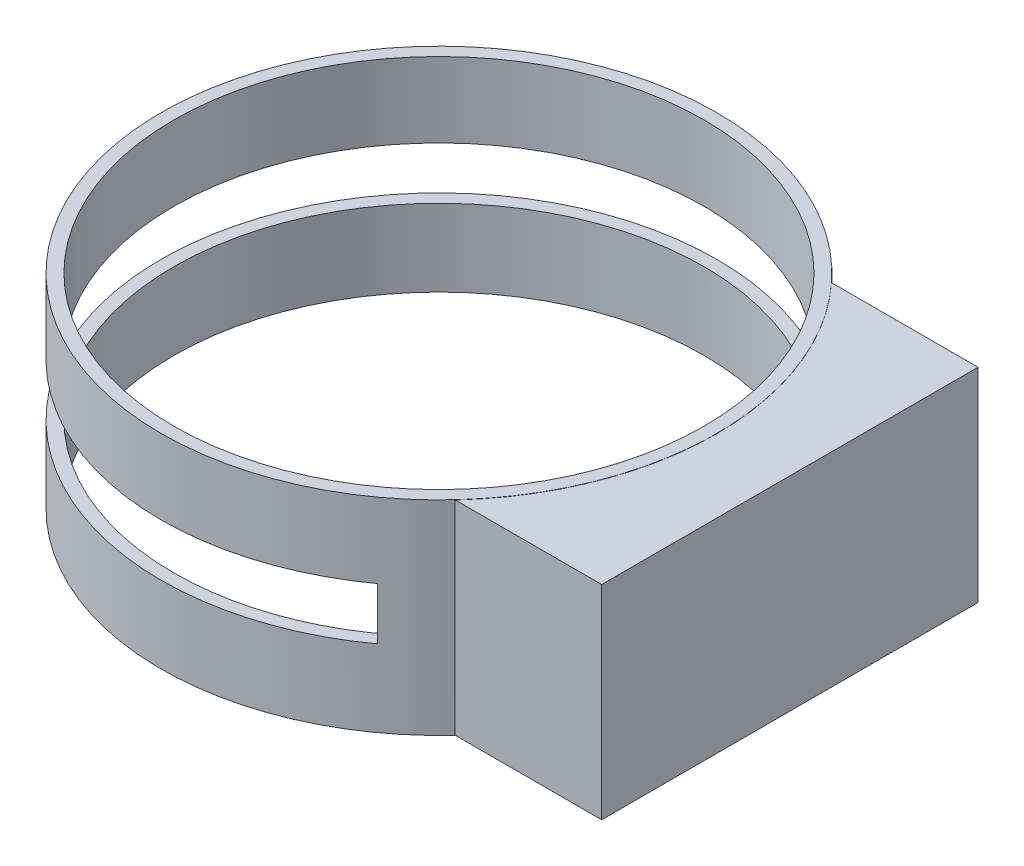
ISO-10303-21;
HEADER;
FILE_DESCRIPTION(('STEP AP214'),'2;1');
FILE_NAME('part.step','',(''),(''),'','','');
FILE_SCHEMA(('AUTOMOTIVE_DESIGN { 1 0 10303 214 1 1 1 1 }'));
ENDSEC;
DATA;
#1=APPLICATION_CONTEXT('core data for automotive mechanical design processes');
#2=APPLICATION_PROTOCOL_DEFINITION('international standard','automotive_design',2000,#1);
#3=PRODUCT_CONTEXT('',#1,'mechanical');
#4=PRODUCT('Part','Part','',(#3));
#5=PRODUCT_RELATED_PRODUCT_CATEGORY('part','',(#4));
#6=PRODUCT_DEFINITION_FORMATION('','',#4);
#7=PRODUCT_DEFINITION_CONTEXT('part definition',#1,'design');
#8=PRODUCT_DEFINITION('design','',#6,#7);
#9=PRODUCT_DEFINITION_SHAPE('','',#8);
#10=(LENGTH_UNIT() NAMED_UNIT(*) SI_UNIT(.MILLI.,.METRE.));
#11=(NAMED_UNIT(*) PLANE_ANGLE_UNIT() SI_UNIT($,.RADIAN.));
#12=(NAMED_UNIT(*) SI_UNIT($,.STERADIAN.) SOLID_ANGLE_UNIT());
#13=UNCERTAINTY_MEASURE_WITH_UNIT(LENGTH_MEASURE(1.E-05),#10,'distance_accuracy_value','');
#14=(GEOMETRIC_REPRESENTATION_CONTEXT(3) GLOBAL_UNCERTAINTY_ASSIGNED_CONTEXT((#13)) GLOBAL_UNIT_ASSIGNED_CONTEXT((#10,
#11,#12)) REPRESENTATION_CONTEXT('',''));
#15=CARTESIAN_POINT('',(0.,0.,0.));
#16=DIRECTION('',(0.,0.,1.));
#17=DIRECTION('',(1.,0.,0.));
#18=AXIS2_PLACEMENT_3D('',#15,#16,#17);
#19=CARTESIAN_POINT('',(0.,50.,0.));
#20=DIRECTION('',(0.,-1.,0.));
#21=DIRECTION('',(0.,0.,-1.));
#22=AXIS2_PLACEMENT_3D('',#19,#20,#21);
#23=CYLINDRICAL_SURFACE('',#22,68.1050389758253);
#24=DIRECTION('',(0.,-1.,0.));
#25=VECTOR('',#24,1.);
#26=CARTESIAN_POINT('',(50.1123956749272,50.,-46.1198886991092));
#27=LINE('',#26,#25);
#28=CARTESIAN_POINT('',(50.1123956749272,0.,-46.1198886991092));
#29=VERTEX_POINT('',#28);
#30=CARTESIAN_POINT('',(50.1123956749272,49.9446513396624,-46.1198886991092));
#31=VERTEX_POINT('',#30);
#32=EDGE_CURVE('E126',#29,#31,#27,.F.);
#33=ORIENTED_EDGE('',*,*,#32,.F.);
#34=CARTESIAN_POINT('',(0.,0.,0.));
#35=DIRECTION('',(0.,1.,0.));
#36=DIRECTION('',(0.,0.,1.));
#37=AXIS2_PLACEMENT_3D('',#34,#35,#36);
#38=CIRCLE('',#37,68.1050389758253);
#39=CARTESIAN_POINT('',(50.1123956749272,0.,46.1198886991092));
#40=VERTEX_POINT('',#39);
#41=EDGE_CURVE('E118',#29,#40,#38,.T.);
#42=ORIENTED_EDGE('',*,*,#41,.T.);
#43=DIRECTION('',(0.,-1.,0.));
#44=VECTOR('',#43,1.);
#45=CARTESIAN_POINT('',(50.1123956749272,50.,46.1198886991092));
#46=LINE('',#45,#44);
#47=CARTESIAN_POINT('',(50.1123956749272,49.9446513396624,46.1198886991092));
#48=VERTEX_POINT('',#47);
#49=EDGE_CURVE('E134',#48,#40,#46,.T.);
#50=ORIENTED_EDGE('',*,*,#49,.F.);
#51=CARTESIAN_POINT('',(0.,49.9446513396624,0.));
#52=DIRECTION('',(0.,-1.,0.));
#53=DIRECTION('',(0.,0.,-1.));
#54=AXIS2_PLACEMENT_3D('',#51,#52,#53);
#55=CIRCLE('',#54,68.1050389758253);
#56=EDGE_CURVE('E131',#31,#48,#55,.T.);
#57=ORIENTED_EDGE('',*,*,#56,.F.);
#58=EDGE_LOOP('',(#33,#42,#50,#57));
#59=FACE_BOUND('',#58,.T.);
#60=CARTESIAN_POINT('',(0.,50.,0.));
#61=DIRECTION('',(0.,1.,0.));
#62=DIRECTION('',(0.,0.,1.));
#63=AXIS2_PLACEMENT_3D('',#60,#61,#62);
#64=CIRCLE('',#63,68.1050389758253);
#65=CARTESIAN_POINT('',(0.,50.,68.1050389758253));
#66=VERTEX_POINT('',#65);
#67=EDGE_CURVE('E104',#66,#66,#64,.T.);
#68=ORIENTED_EDGE('',*,*,#67,.F.);
#69=EDGE_LOOP('',(#68));
#70=FACE_BOUND('',#69,.T.);
#71=DIRECTION('',(0.,-1.,0.));
#72=VECTOR('',#71,1.);
#73=CARTESIAN_POINT('',(40.,50.,-55.1207432270165));
#74=LINE('',#73,#72);
#75=CARTESIAN_POINT('',(40.,31.649611071765,-55.1207432270165));
#76=VERTEX_POINT('',#75);
#77=CARTESIAN_POINT('',(40.,18.8522463676127,-55.1207432270165));
#78=VERTEX_POINT('',#77);
#79=EDGE_CURVE('E162',#76,#78,#74,.T.);
#80=ORIENTED_EDGE('',*,*,#79,.F.);
#81=CARTESIAN_POINT('',(0.,31.649611071765,0.));
#82=DIRECTION('',(0.,1.,0.));
#83=DIRECTION('',(0.,0.,1.));
#84=AXIS2_PLACEMENT_3D('',#81,#82,#83);
#85=CIRCLE('',#84,68.1050389758253);
#86=CARTESIAN_POINT('',(40.,31.649611071765,55.1207432270165));
#87=VERTEX_POINT('',#86);
#88=EDGE_CURVE('E158',#76,#87,#85,.T.);
#89=ORIENTED_EDGE('',*,*,#88,.T.);
#90=DIRECTION('',(0.,-1.,0.));
#91=VECTOR('',#90,1.);
#92=CARTESIAN_POINT('',(40.,50.,55.1207432270165));
#93=LINE('',#92,#91);
#94=CARTESIAN_POINT('',(40.,18.8522463676127,55.1207432270165));
#95=VERTEX_POINT('',#94);
#96=EDGE_CURVE('E164',#95,#87,#93,.F.);
#97=ORIENTED_EDGE('',*,*,#96,.F.);
#98=CARTESIAN_POINT('',(0.,18.8522463676127,0.));
#99=DIRECTION('',(0.,-1.,0.));
#100=DIRECTION('',(0.,0.,-1.));
#101=AXIS2_PLACEMENT_3D('',#98,#99,#100);
#102=CIRCLE('',#101,68.1050389758253);
#103=EDGE_CURVE('E111',#95,#78,#102,.T.);
#104=ORIENTED_EDGE('',*,*,#103,.T.);
#105=EDGE_LOOP('',(#80,#89,#97,#104));
#106=FACE_BOUND('',#105,.T.);
#107=ADVANCED_FACE('F37',(#59,#70,#106),#23,.T.);
#108=CARTESIAN_POINT('',(0.,50.,0.));
#109=DIRECTION('',(0.,-1.,0.));
#110=DIRECTION('',(0.,0.,-1.));
#111=AXIS2_PLACEMENT_3D('',#108,#109,#110);
#112=CYLINDRICAL_SURFACE('',#111,65.);
#113=CARTESIAN_POINT('',(0.,0.,0.));
#114=DIRECTION('',(0.,1.,0.));
#115=DIRECTION('',(0.,0.,1.));
#116=AXIS2_PLACEMENT_3D('',#113,#114,#115);
#117=CIRCLE('',#116,65.);
#118=CARTESIAN_POINT('',(0.,0.,65.));
#119=VERTEX_POINT('',#118);
#120=EDGE_CURVE('E123',#119,#119,#117,.T.);
#121=ORIENTED_EDGE('',*,*,#120,.F.);
#122=EDGE_LOOP('',(#121));
#123=FACE_BOUND('',#122,.T.);
#124=CARTESIAN_POINT('',(0.,50.,0.));
#125=DIRECTION('',(0.,1.,0.));
#126=DIRECTION('',(0.,0.,1.));
#127=AXIS2_PLACEMENT_3D('',#124,#125,#126);
#128=CIRCLE('',#127,65.);
#129=CARTESIAN_POINT('',(0.,50.,65.));
#130=VERTEX_POINT('',#129);
#131=EDGE_CURVE('E120',#130,#130,#128,.T.);
#132=ORIENTED_EDGE('',*,*,#131,.T.);
#133=EDGE_LOOP('',(#132));
#134=FACE_BOUND('',#133,.T.);
#135=CARTESIAN_POINT('',(0.,31.649611071765,0.));
#136=DIRECTION('',(0.,1.,0.));
#137=DIRECTION('',(0.,0.,1.));
#138=AXIS2_PLACEMENT_3D('',#135,#136,#137);
#139=CIRCLE('',#138,65.);
#140=CARTESIAN_POINT('',(40.,31.649611071765,-51.234753829798));
#141=VERTEX_POINT('',#140);
#142=CARTESIAN_POINT('',(40.,31.649611071765,51.234753829798));
#143=VERTEX_POINT('',#142);
#144=EDGE_CURVE('E44',#141,#143,#139,.T.);
#145=ORIENTED_EDGE('',*,*,#144,.F.);
#146=DIRECTION('',(0.,-1.,0.));
#147=VECTOR('',#146,1.);
#148=CARTESIAN_POINT('',(40.,50.,-51.234753829798));
#149=LINE('',#148,#147);
#150=CARTESIAN_POINT('',(40.,18.8522463676127,-51.234753829798));
#151=VERTEX_POINT('',#150);
#152=EDGE_CURVE('E11',#141,#151,#149,.T.);
#153=ORIENTED_EDGE('',*,*,#152,.T.);
#154=CARTESIAN_POINT('',(0.,18.8522463676127,0.));
#155=DIRECTION('',(0.,-1.,0.));
#156=DIRECTION('',(0.,0.,-1.));
#157=AXIS2_PLACEMENT_3D('',#154,#155,#156);
#158=CIRCLE('',#157,65.);
#159=CARTESIAN_POINT('',(40.,18.8522463676127,51.234753829798));
#160=VERTEX_POINT('',#159);
#161=EDGE_CURVE('E103',#160,#151,#158,.T.);
#162=ORIENTED_EDGE('',*,*,#161,.F.);
#163=DIRECTION('',(0.,-1.,0.));
#164=VECTOR('',#163,1.);
#165=CARTESIAN_POINT('',(40.,50.,51.234753829798));
#166=LINE('',#165,#164);
#167=EDGE_CURVE('E98',#160,#143,#166,.F.);
#168=ORIENTED_EDGE('',*,*,#167,.T.);
#169=EDGE_LOOP('',(#145,#153,#162,#168));
#170=FACE_BOUND('',#169,.T.);
#171=ADVANCED_FACE('F115',(#123,#134,#170),#112,.F.);
#172=CARTESIAN_POINT('',(0.,50.,0.));
#173=DIRECTION('',(0.,1.,0.));
#174=DIRECTION('',(0.,0.,1.));
#175=AXIS2_PLACEMENT_3D('',#172,#173,#174);
#176=PLANE('',#175);
#177=ORIENTED_EDGE('',*,*,#67,.T.);
#178=EDGE_LOOP('',(#177));
#179=FACE_BOUND('',#178,.T.);
#180=ORIENTED_EDGE('',*,*,#131,.F.);
#181=EDGE_LOOP('',(#180));
#182=FACE_BOUND('',#181,.T.);
#183=ADVANCED_FACE('F188',(#179,#182),#176,.T.);
#184=CARTESIAN_POINT('',(0.,0.,0.));
#185=DIRECTION('',(0.,1.,0.));
#186=DIRECTION('',(0.,0.,1.));
#187=AXIS2_PLACEMENT_3D('',#184,#185,#186);
#188=PLANE('',#187);
#189=ORIENTED_EDGE('',*,*,#41,.F.);
#190=DIRECTION('',(-1.,0.,0.));
#191=VECTOR('',#190,1.);
#192=CARTESIAN_POINT('',(86.,0.,-46.1198886991092));
#193=LINE('',#192,#191);
#194=CARTESIAN_POINT('',(86.,0.,-46.1198886991092));
#195=VERTEX_POINT('',#194);
#196=EDGE_CURVE('E146',#195,#29,#193,.T.);
#197=ORIENTED_EDGE('',*,*,#196,.F.);
#198=DIRECTION('',(0.,0.,-1.));
#199=VECTOR('',#198,1.);
#200=CARTESIAN_POINT('',(86.,0.,46.1198886991092));
#201=LINE('',#200,#199);
#202=CARTESIAN_POINT('',(86.,0.,46.1198886991092));
#203=VERTEX_POINT('',#202);
#204=EDGE_CURVE('E149',#203,#195,#201,.T.);
#205=ORIENTED_EDGE('',*,*,#204,.F.);
#206=DIRECTION('',(-1.,0.,0.));
#207=VECTOR('',#206,1.);
#208=CARTESIAN_POINT('',(86.,0.,46.1198886991092));
#209=LINE('',#208,#207);
#210=EDGE_CURVE('E143',#203,#40,#209,.T.);
#211=ORIENTED_EDGE('',*,*,#210,.T.);
#212=EDGE_LOOP('',(#189,#197,#205,#211));
#213=FACE_BOUND('',#212,.T.);
#214=ORIENTED_EDGE('',*,*,#120,.T.);
#215=EDGE_LOOP('',(#214));
#216=FACE_BOUND('',#215,.T.);
#217=ADVANCED_FACE('F197',(#213,#216),#188,.F.);
#218=CARTESIAN_POINT('',(86.,49.9446513396624,-46.1198886991092));
#219=DIRECTION('',(0.,0.,1.));
#220=DIRECTION('',(1.,0.,0.));
#221=AXIS2_PLACEMENT_3D('',#218,#219,#220);
#222=PLANE('',#221);
#223=ORIENTED_EDGE('',*,*,#196,.T.);
#224=ORIENTED_EDGE('',*,*,#32,.T.);
#225=DIRECTION('',(-1.,0.,0.));
#226=VECTOR('',#225,1.);
#227=CARTESIAN_POINT('',(86.,49.9446513396624,-46.1198886991092));
#228=LINE('',#227,#226);
#229=CARTESIAN_POINT('',(86.,49.9446513396624,-46.1198886991092));
#230=VERTEX_POINT('',#229);
#231=EDGE_CURVE('E137',#230,#31,#228,.T.);
#232=ORIENTED_EDGE('',*,*,#231,.F.);
#233=DIRECTION('',(0.,1.,0.));
#234=VECTOR('',#233,1.);
#235=CARTESIAN_POINT('',(86.,49.9446513396624,-46.1198886991092));
#236=LINE('',#235,#234);
#237=EDGE_CURVE('E155',#195,#230,#236,.T.);
#238=ORIENTED_EDGE('',*,*,#237,.F.);
#239=EDGE_LOOP('',(#223,#224,#232,#238));
#240=FACE_BOUND('',#239,.T.);
#241=ADVANCED_FACE('F204',(#240),#222,.F.);
#242=CARTESIAN_POINT('',(86.,49.9446513396624,46.1198886991092));
#243=DIRECTION('',(0.,0.,-1.));
#244=DIRECTION('',(-1.,0.,0.));
#245=AXIS2_PLACEMENT_3D('',#242,#243,#244);
#246=PLANE('',#245);
#247=DIRECTION('',(-1.,0.,0.));
#248=VECTOR('',#247,1.);
#249=CARTESIAN_POINT('',(86.,49.9446513396624,46.1198886991092));
#250=LINE('',#249,#248);
#251=CARTESIAN_POINT('',(86.,49.9446513396624,46.1198886991092));
#252=VERTEX_POINT('',#251);
#253=EDGE_CURVE('E140',#252,#48,#250,.T.);
#254=ORIENTED_EDGE('',*,*,#253,.T.);
#255=ORIENTED_EDGE('',*,*,#49,.T.);
#256=ORIENTED_EDGE('',*,*,#210,.F.);
#257=DIRECTION('',(0.,-1.,0.));
#258=VECTOR('',#257,1.);
#259=CARTESIAN_POINT('',(86.,49.9446513396624,46.1198886991092));
#260=LINE('',#259,#258);
#261=EDGE_CURVE('E151',#252,#203,#260,.T.);
#262=ORIENTED_EDGE('',*,*,#261,.F.);
#263=EDGE_LOOP('',(#254,#255,#256,#262));
#264=FACE_BOUND('',#263,.T.);
#265=ADVANCED_FACE('F209',(#264),#246,.F.);
#266=CARTESIAN_POINT('',(86.,49.9446513396624,46.1198886991092));
#267=DIRECTION('',(0.,-1.,0.));
#268=DIRECTION('',(0.,0.,-1.));
#269=AXIS2_PLACEMENT_3D('',#266,#267,#268);
#270=PLANE('',#269);
#271=ORIENTED_EDGE('',*,*,#231,.T.);
#272=ORIENTED_EDGE('',*,*,#56,.T.);
#273=ORIENTED_EDGE('',*,*,#253,.F.);
#274=DIRECTION('',(0.,0.,1.));
#275=VECTOR('',#274,1.);
#276=CARTESIAN_POINT('',(86.,49.9446513396624,46.1198886991092));
#277=LINE('',#276,#275);
#278=EDGE_CURVE('E153',#230,#252,#277,.T.);
#279=ORIENTED_EDGE('',*,*,#278,.F.);
#280=EDGE_LOOP('',(#271,#272,#273,#279));
#281=FACE_BOUND('',#280,.T.);
#282=ADVANCED_FACE('F211',(#281),#270,.F.);
#283=CARTESIAN_POINT('',(86.,0.,0.));
#284=DIRECTION('',(1.,0.,0.));
#285=DIRECTION('',(0.,0.,-1.));
#286=AXIS2_PLACEMENT_3D('',#283,#284,#285);
#287=PLANE('',#286);
#288=ORIENTED_EDGE('',*,*,#237,.T.);
#289=ORIENTED_EDGE('',*,*,#278,.T.);
#290=ORIENTED_EDGE('',*,*,#261,.T.);
#291=ORIENTED_EDGE('',*,*,#204,.T.);
#292=EDGE_LOOP('',(#288,#289,#290,#291));
#293=FACE_BOUND('',#292,.T.);
#294=ADVANCED_FACE('F214',(#293),#287,.T.);
#295=CARTESIAN_POINT('',(-104.,31.649611071765,-77.0734293837035));
#296=DIRECTION('',(0.,1.,0.));
#297=DIRECTION('',(0.,0.,1.));
#298=AXIS2_PLACEMENT_3D('',#295,#296,#297);
#299=PLANE('',#298);
#300=DIRECTION('',(0.,0.,1.));
#301=VECTOR('',#300,1.);
#302=CARTESIAN_POINT('',(40.,31.649611071765,-77.0734293837035));
#303=LINE('',#302,#301);
#304=EDGE_CURVE('E166',#76,#141,#303,.T.);
#305=ORIENTED_EDGE('',*,*,#304,.T.);
#306=ORIENTED_EDGE('',*,*,#144,.T.);
#307=EDGE_CURVE('E56',#143,#87,#303,.T.);
#308=ORIENTED_EDGE('',*,*,#307,.T.);
#309=ORIENTED_EDGE('',*,*,#88,.F.);
#310=EDGE_LOOP('',(#305,#306,#308,#309));
#311=FACE_BOUND('',#310,.T.);
#312=ADVANCED_FACE('F172',(#311),#299,.F.);
#313=CARTESIAN_POINT('',(-104.,18.8522463676127,-77.0734293837035));
#314=DIRECTION('',(0.,-1.,0.));
#315=DIRECTION('',(0.,0.,-1.));
#316=AXIS2_PLACEMENT_3D('',#313,#314,#315);
#317=PLANE('',#316);
#318=DIRECTION('',(0.,0.,-1.));
#319=VECTOR('',#318,1.);
#320=CARTESIAN_POINT('',(40.,18.8522463676127,-77.0734293837035));
#321=LINE('',#320,#319);
#322=EDGE_CURVE('E51',#95,#160,#321,.T.);
#323=ORIENTED_EDGE('',*,*,#322,.T.);
#324=ORIENTED_EDGE('',*,*,#161,.T.);
#325=EDGE_CURVE('E113',#151,#78,#321,.T.);
#326=ORIENTED_EDGE('',*,*,#325,.T.);
#327=ORIENTED_EDGE('',*,*,#103,.F.);
#328=EDGE_LOOP('',(#323,#324,#326,#327));
#329=FACE_BOUND('',#328,.T.);
#330=ADVANCED_FACE('F107',(#329),#317,.F.);
#331=CARTESIAN_POINT('',(40.,0.,0.));
#332=DIRECTION('',(-1.,0.,0.));
#333=DIRECTION('',(0.,0.,1.));
#334=AXIS2_PLACEMENT_3D('',#331,#332,#333);
#335=PLANE('',#334);
#336=ORIENTED_EDGE('',*,*,#79,.T.);
#337=ORIENTED_EDGE('',*,*,#325,.F.);
#338=ORIENTED_EDGE('',*,*,#152,.F.);
#339=ORIENTED_EDGE('',*,*,#304,.F.);
#340=EDGE_LOOP('',(#336,#337,#338,#339));
#341=FACE_BOUND('',#340,.T.);
#342=ADVANCED_FACE('F174',(#341),#335,.T.);
#343=ORIENTED_EDGE('',*,*,#96,.T.);
#344=ORIENTED_EDGE('',*,*,#307,.F.);
#345=ORIENTED_EDGE('',*,*,#167,.F.);
#346=ORIENTED_EDGE('',*,*,#322,.F.);
#347=EDGE_LOOP('',(#343,#344,#345,#346));
#348=FACE_BOUND('',#347,.T.);
#349=ADVANCED_FACE('F99',(#348),#335,.T.);
#350=CLOSED_SHELL('',(#107,#171,#183,#217,#241,#265,#282,#294,#312,#330,#342,#349));
#351=MANIFOLD_SOLID_BREP('B2',#350);
#352=ADVANCED_BREP_SHAPE_REPRESENTATION('',(#18,#351),#14);
#353=SHAPE_DEFINITION_REPRESENTATION(#9,#352);
ENDSEC;
END-ISO-10303-21;
